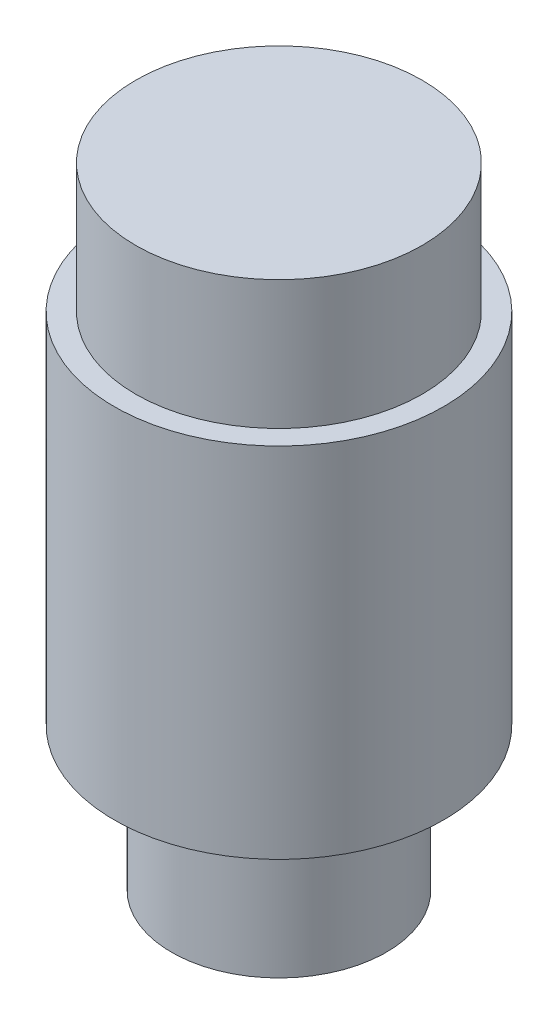
ISO-10303-21;
HEADER;
FILE_DESCRIPTION(('STEP AP214'),'2;1');
FILE_NAME('part.step','',(''),(''),'','','');
FILE_SCHEMA(('AUTOMOTIVE_DESIGN { 1 0 10303 214 1 1 1 1 }'));
ENDSEC;
DATA;
#1=APPLICATION_CONTEXT('core data for automotive mechanical design processes');
#2=APPLICATION_PROTOCOL_DEFINITION('international standard','automotive_design',2000,#1);
#3=PRODUCT_CONTEXT('',#1,'mechanical');
#4=PRODUCT('Part','Part','',(#3));
#5=PRODUCT_RELATED_PRODUCT_CATEGORY('part','',(#4));
#6=PRODUCT_DEFINITION_FORMATION('','',#4);
#7=PRODUCT_DEFINITION_CONTEXT('part definition',#1,'design');
#8=PRODUCT_DEFINITION('design','',#6,#7);
#9=PRODUCT_DEFINITION_SHAPE('','',#8);
#10=(LENGTH_UNIT() NAMED_UNIT(*) SI_UNIT(.MILLI.,.METRE.));
#11=(NAMED_UNIT(*) PLANE_ANGLE_UNIT() SI_UNIT($,.RADIAN.));
#12=(NAMED_UNIT(*) SI_UNIT($,.STERADIAN.) SOLID_ANGLE_UNIT());
#13=UNCERTAINTY_MEASURE_WITH_UNIT(LENGTH_MEASURE(1.E-05),#10,'distance_accuracy_value','');
#14=(GEOMETRIC_REPRESENTATION_CONTEXT(3) GLOBAL_UNCERTAINTY_ASSIGNED_CONTEXT((#13)) GLOBAL_UNIT_ASSIGNED_CONTEXT((#10,
#11,#12)) REPRESENTATION_CONTEXT('',''));
#15=CARTESIAN_POINT('',(0.,0.,0.));
#16=DIRECTION('',(0.,0.,1.));
#17=DIRECTION('',(1.,0.,0.));
#18=AXIS2_PLACEMENT_3D('',#15,#16,#17);
#19=CARTESIAN_POINT('',(0.,0.,0.));
#20=DIRECTION('',(0.,1.,0.));
#21=DIRECTION('',(0.,0.,1.));
#22=AXIS2_PLACEMENT_3D('',#19,#20,#21);
#23=PLANE('',#22);
#24=CARTESIAN_POINT('',(0.,0.,0.));
#25=DIRECTION('',(0.,-1.,0.));
#26=DIRECTION('',(0.,0.,-1.));
#27=AXIS2_PLACEMENT_3D('',#24,#25,#26);
#28=CIRCLE('',#27,10.);
#29=CARTESIAN_POINT('',(0.,0.,-10.));
#30=VERTEX_POINT('',#29);
#31=EDGE_CURVE('E10',#30,#30,#28,.T.);
#32=ORIENTED_EDGE('',*,*,#31,.F.);
#33=EDGE_LOOP('',(#32));
#34=FACE_BOUND('',#33,.T.);
#35=ADVANCED_FACE('F33',(#34),#23,.T.);
#36=CARTESIAN_POINT('',(0.,-44.,0.));
#37=DIRECTION('',(0.,-1.,0.));
#38=DIRECTION('',(0.,0.,-1.));
#39=AXIS2_PLACEMENT_3D('',#36,#37,#38);
#40=CYLINDRICAL_SURFACE('',#39,10.);
#41=ORIENTED_EDGE('',*,*,#31,.T.);
#42=EDGE_LOOP('',(#41));
#43=FACE_BOUND('',#42,.T.);
#44=CARTESIAN_POINT('',(0.,-9.,0.));
#45=DIRECTION('',(0.,-1.,0.));
#46=DIRECTION('',(0.,0.,-1.));
#47=AXIS2_PLACEMENT_3D('',#44,#45,#46);
#48=CIRCLE('',#47,10.);
#49=CARTESIAN_POINT('',(0.,-9.,-10.));
#50=VERTEX_POINT('',#49);
#51=EDGE_CURVE('E39',#50,#50,#48,.T.);
#52=ORIENTED_EDGE('',*,*,#51,.F.);
#53=EDGE_LOOP('',(#52));
#54=FACE_BOUND('',#53,.T.);
#55=ADVANCED_FACE('F75',(#43,#54),#40,.T.);
#56=CARTESIAN_POINT('',(10.,-9.,0.));
#57=DIRECTION('',(0.,1.,0.));
#58=DIRECTION('',(0.,0.,1.));
#59=AXIS2_PLACEMENT_3D('',#56,#57,#58);
#60=PLANE('',#59);
#61=ORIENTED_EDGE('',*,*,#51,.T.);
#62=EDGE_LOOP('',(#61));
#63=FACE_BOUND('',#62,.T.);
#64=CARTESIAN_POINT('',(0.,-9.,0.));
#65=DIRECTION('',(0.,-1.,0.));
#66=DIRECTION('',(0.,0.,-1.));
#67=AXIS2_PLACEMENT_3D('',#64,#65,#66);
#68=CIRCLE('',#67,11.5);
#69=CARTESIAN_POINT('',(0.,-9.,-11.5));
#70=VERTEX_POINT('',#69);
#71=EDGE_CURVE('E43',#70,#70,#68,.T.);
#72=ORIENTED_EDGE('',*,*,#71,.F.);
#73=EDGE_LOOP('',(#72));
#74=FACE_BOUND('',#73,.T.);
#75=ADVANCED_FACE('F80',(#63,#74),#60,.T.);
#76=CARTESIAN_POINT('',(0.,-44.,0.));
#77=DIRECTION('',(0.,-1.,0.));
#78=DIRECTION('',(0.,0.,-1.));
#79=AXIS2_PLACEMENT_3D('',#76,#77,#78);
#80=CYLINDRICAL_SURFACE('',#79,11.5);
#81=ORIENTED_EDGE('',*,*,#71,.T.);
#82=EDGE_LOOP('',(#81));
#83=FACE_BOUND('',#82,.T.);
#84=CARTESIAN_POINT('',(0.,-34.,0.));
#85=DIRECTION('',(0.,-1.,0.));
#86=DIRECTION('',(0.,0.,-1.));
#87=AXIS2_PLACEMENT_3D('',#84,#85,#86);
#88=CIRCLE('',#87,11.5);
#89=CARTESIAN_POINT('',(0.,-34.,-11.5));
#90=VERTEX_POINT('',#89);
#91=EDGE_CURVE('E47',#90,#90,#88,.T.);
#92=ORIENTED_EDGE('',*,*,#91,.F.);
#93=EDGE_LOOP('',(#92));
#94=FACE_BOUND('',#93,.T.);
#95=ADVANCED_FACE('F71',(#83,#94),#80,.T.);
#96=CARTESIAN_POINT('',(11.5,-34.,0.));
#97=DIRECTION('',(0.,-1.,0.));
#98=DIRECTION('',(0.,0.,-1.));
#99=AXIS2_PLACEMENT_3D('',#96,#97,#98);
#100=PLANE('',#99);
#101=ORIENTED_EDGE('',*,*,#91,.T.);
#102=EDGE_LOOP('',(#101));
#103=FACE_BOUND('',#102,.T.);
#104=CARTESIAN_POINT('',(0.,-34.,0.));
#105=DIRECTION('',(0.,-1.,0.));
#106=DIRECTION('',(0.,0.,-1.));
#107=AXIS2_PLACEMENT_3D('',#104,#105,#106);
#108=CIRCLE('',#107,7.5);
#109=CARTESIAN_POINT('',(0.,-34.,-7.5));
#110=VERTEX_POINT('',#109);
#111=EDGE_CURVE('E52',#110,#110,#108,.T.);
#112=ORIENTED_EDGE('',*,*,#111,.F.);
#113=EDGE_LOOP('',(#112));
#114=FACE_BOUND('',#113,.T.);
#115=ADVANCED_FACE('F63',(#103,#114),#100,.T.);
#116=CARTESIAN_POINT('',(0.,-44.,0.));
#117=DIRECTION('',(0.,-1.,0.));
#118=DIRECTION('',(0.,0.,-1.));
#119=AXIS2_PLACEMENT_3D('',#116,#117,#118);
#120=CYLINDRICAL_SURFACE('',#119,7.5);
#121=ORIENTED_EDGE('',*,*,#111,.T.);
#122=EDGE_LOOP('',(#121));
#123=FACE_BOUND('',#122,.T.);
#124=CARTESIAN_POINT('',(0.,-44.,0.));
#125=DIRECTION('',(0.,-1.,0.));
#126=DIRECTION('',(0.,0.,-1.));
#127=AXIS2_PLACEMENT_3D('',#124,#125,#126);
#128=CIRCLE('',#127,7.5);
#129=CARTESIAN_POINT('',(0.,-44.,-7.5));
#130=VERTEX_POINT('',#129);
#131=EDGE_CURVE('E55',#130,#130,#128,.T.);
#132=ORIENTED_EDGE('',*,*,#131,.F.);
#133=EDGE_LOOP('',(#132));
#134=FACE_BOUND('',#133,.T.);
#135=ADVANCED_FACE('F61',(#123,#134),#120,.T.);
#136=CARTESIAN_POINT('',(7.5,-44.,0.));
#137=DIRECTION('',(0.,-1.,0.));
#138=DIRECTION('',(0.,0.,-1.));
#139=AXIS2_PLACEMENT_3D('',#136,#137,#138);
#140=PLANE('',#139);
#141=ORIENTED_EDGE('',*,*,#131,.T.);
#142=EDGE_LOOP('',(#141));
#143=FACE_BOUND('',#142,.T.);
#144=ADVANCED_FACE('F59',(#143),#140,.T.);
#145=CLOSED_SHELL('',(#35,#55,#75,#95,#115,#135,#144));
#146=MANIFOLD_SOLID_BREP('B2',#145);
#147=ADVANCED_BREP_SHAPE_REPRESENTATION('',(#18,#146),#14);
#148=SHAPE_DEFINITION_REPRESENTATION(#9,#147);
ENDSEC;
END-ISO-10303-21;
